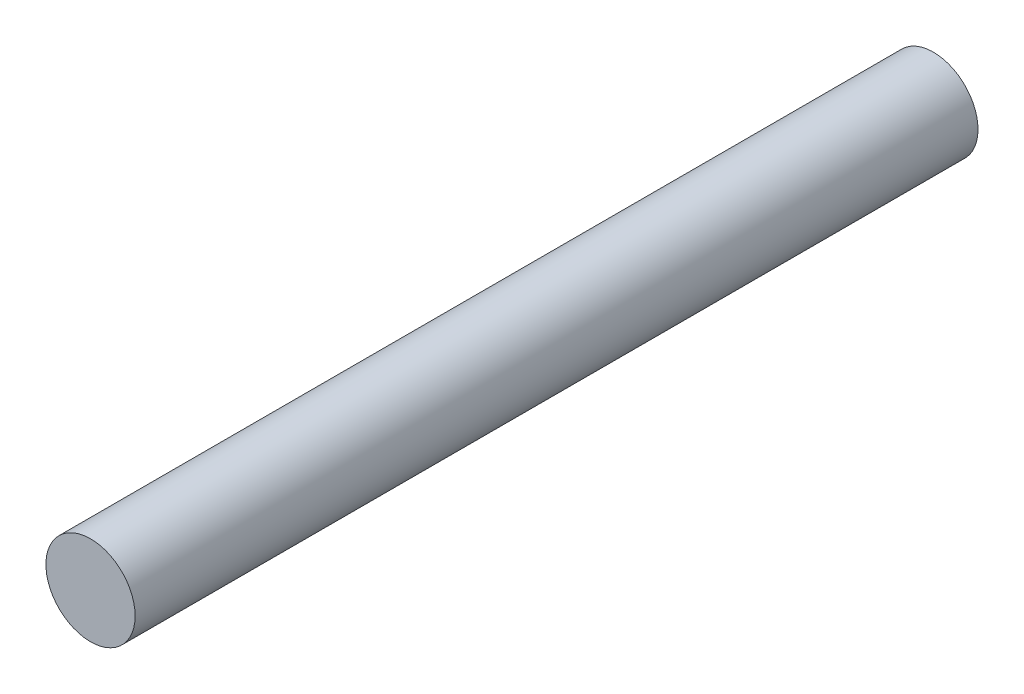
ISO-10303-21;
HEADER;
FILE_DESCRIPTION(('STEP AP214'),'2;1');
FILE_NAME('part.step','',(''),(''),'','','');
FILE_SCHEMA(('AUTOMOTIVE_DESIGN { 1 0 10303 214 1 1 1 1 }'));
ENDSEC;
DATA;
#1=APPLICATION_CONTEXT('core data for automotive mechanical design processes');
#2=APPLICATION_PROTOCOL_DEFINITION('international standard','automotive_design',2000,#1);
#3=PRODUCT_CONTEXT('',#1,'mechanical');
#4=PRODUCT('Part','Part','',(#3));
#5=PRODUCT_RELATED_PRODUCT_CATEGORY('part','',(#4));
#6=PRODUCT_DEFINITION_FORMATION('','',#4);
#7=PRODUCT_DEFINITION_CONTEXT('part definition',#1,'design');
#8=PRODUCT_DEFINITION('design','',#6,#7);
#9=PRODUCT_DEFINITION_SHAPE('','',#8);
#10=(LENGTH_UNIT() NAMED_UNIT(*) SI_UNIT(.MILLI.,.METRE.));
#11=(NAMED_UNIT(*) PLANE_ANGLE_UNIT() SI_UNIT($,.RADIAN.));
#12=(NAMED_UNIT(*) SI_UNIT($,.STERADIAN.) SOLID_ANGLE_UNIT());
#13=UNCERTAINTY_MEASURE_WITH_UNIT(LENGTH_MEASURE(1.E-05),#10,'distance_accuracy_value','');
#14=(GEOMETRIC_REPRESENTATION_CONTEXT(3) GLOBAL_UNCERTAINTY_ASSIGNED_CONTEXT((#13)) GLOBAL_UNIT_ASSIGNED_CONTEXT((#10,
#11,#12)) REPRESENTATION_CONTEXT('',''));
#15=CARTESIAN_POINT('',(0.,0.,0.));
#16=DIRECTION('',(0.,0.,1.));
#17=DIRECTION('',(1.,0.,0.));
#18=AXIS2_PLACEMENT_3D('',#15,#16,#17);
#19=CARTESIAN_POINT('',(0.,0.,470.02));
#20=DIRECTION('',(0.,0.,-1.));
#21=DIRECTION('',(-1.,0.,0.));
#22=AXIS2_PLACEMENT_3D('',#19,#20,#21);
#23=CYLINDRICAL_SURFACE('',#22,24.875);
#24=CARTESIAN_POINT('',(0.,0.,470.02));
#25=DIRECTION('',(0.,0.,1.));
#26=DIRECTION('',(1.,0.,0.));
#27=AXIS2_PLACEMENT_3D('',#24,#25,#26);
#28=CIRCLE('',#27,24.875);
#29=CARTESIAN_POINT('',(24.875,0.,470.02));
#30=VERTEX_POINT('',#29);
#31=EDGE_CURVE('E10',#30,#30,#28,.T.);
#32=ORIENTED_EDGE('',*,*,#31,.F.);
#33=EDGE_LOOP('',(#32));
#34=FACE_BOUND('',#33,.T.);
#35=CARTESIAN_POINT('',(0.,0.,0.));
#36=DIRECTION('',(0.,0.,1.));
#37=DIRECTION('',(1.,0.,0.));
#38=AXIS2_PLACEMENT_3D('',#35,#36,#37);
#39=CIRCLE('',#38,24.875);
#40=CARTESIAN_POINT('',(24.875,0.,0.));
#41=VERTEX_POINT('',#40);
#42=EDGE_CURVE('E36',#41,#41,#39,.T.);
#43=ORIENTED_EDGE('',*,*,#42,.T.);
#44=EDGE_LOOP('',(#43));
#45=FACE_BOUND('',#44,.T.);
#46=ADVANCED_FACE('F33',(#34,#45),#23,.T.);
#47=CARTESIAN_POINT('',(0.,0.,470.02));
#48=DIRECTION('',(0.,0.,1.));
#49=DIRECTION('',(1.,0.,0.));
#50=AXIS2_PLACEMENT_3D('',#47,#48,#49);
#51=PLANE('',#50);
#52=ORIENTED_EDGE('',*,*,#31,.T.);
#53=EDGE_LOOP('',(#52));
#54=FACE_BOUND('',#53,.T.);
#55=ADVANCED_FACE('F48',(#54),#51,.T.);
#56=CARTESIAN_POINT('',(0.,0.,0.));
#57=DIRECTION('',(0.,0.,1.));
#58=DIRECTION('',(1.,0.,0.));
#59=AXIS2_PLACEMENT_3D('',#56,#57,#58);
#60=PLANE('',#59);
#61=ORIENTED_EDGE('',*,*,#42,.F.);
#62=EDGE_LOOP('',(#61));
#63=FACE_BOUND('',#62,.T.);
#64=ADVANCED_FACE('F46',(#63),#60,.F.);
#65=CLOSED_SHELL('',(#46,#55,#64));
#66=MANIFOLD_SOLID_BREP('B2',#65);
#67=ADVANCED_BREP_SHAPE_REPRESENTATION('',(#18,#66),#14);
#68=SHAPE_DEFINITION_REPRESENTATION(#9,#67);
ENDSEC;
END-ISO-10303-21;
